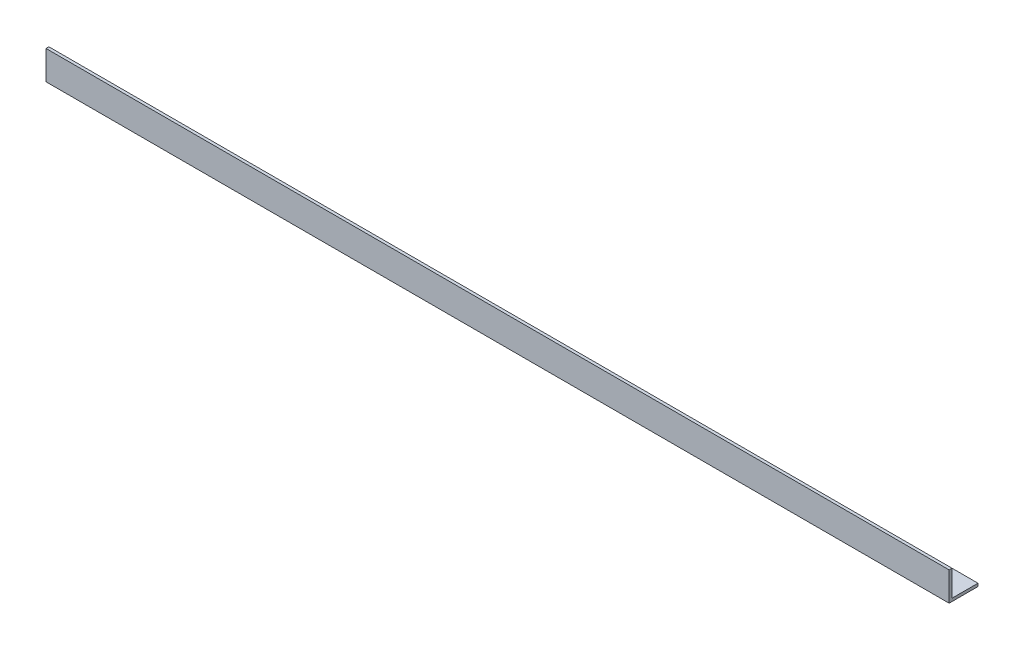
ISO-10303-21;
HEADER;
FILE_DESCRIPTION(('STEP AP214'),'2;1');
FILE_NAME('part.step','',(''),(''),'','','');
FILE_SCHEMA(('AUTOMOTIVE_DESIGN { 1 0 10303 214 1 1 1 1 }'));
ENDSEC;
DATA;
#1=APPLICATION_CONTEXT('core data for automotive mechanical design processes');
#2=APPLICATION_PROTOCOL_DEFINITION('international standard','automotive_design',2000,#1);
#3=PRODUCT_CONTEXT('',#1,'mechanical');
#4=PRODUCT('Part','Part','',(#3));
#5=PRODUCT_RELATED_PRODUCT_CATEGORY('part','',(#4));
#6=PRODUCT_DEFINITION_FORMATION('','',#4);
#7=PRODUCT_DEFINITION_CONTEXT('part definition',#1,'design');
#8=PRODUCT_DEFINITION('design','',#6,#7);
#9=PRODUCT_DEFINITION_SHAPE('','',#8);
#10=(LENGTH_UNIT() NAMED_UNIT(*) SI_UNIT(.MILLI.,.METRE.));
#11=(NAMED_UNIT(*) PLANE_ANGLE_UNIT() SI_UNIT($,.RADIAN.));
#12=(NAMED_UNIT(*) SI_UNIT($,.STERADIAN.) SOLID_ANGLE_UNIT());
#13=UNCERTAINTY_MEASURE_WITH_UNIT(LENGTH_MEASURE(1.E-05),#10,'distance_accuracy_value','');
#14=(GEOMETRIC_REPRESENTATION_CONTEXT(3) GLOBAL_UNCERTAINTY_ASSIGNED_CONTEXT((#13)) GLOBAL_UNIT_ASSIGNED_CONTEXT((#10,
#11,#12)) REPRESENTATION_CONTEXT('',''));
#15=CARTESIAN_POINT('',(0.,0.,0.));
#16=DIRECTION('',(0.,0.,1.));
#17=DIRECTION('',(1.,0.,0.));
#18=AXIS2_PLACEMENT_3D('',#15,#16,#17);
#19=CARTESIAN_POINT('',(469.,0.,-15.));
#20=DIRECTION('',(0.,1.,0.));
#21=DIRECTION('',(0.,0.,1.));
#22=AXIS2_PLACEMENT_3D('',#19,#20,#21);
#23=PLANE('',#22);
#24=DIRECTION('',(0.,0.,-1.));
#25=VECTOR('',#24,1.);
#26=CARTESIAN_POINT('',(0.,0.,-15.));
#27=LINE('',#26,#25);
#28=CARTESIAN_POINT('',(0.,0.,0.));
#29=VERTEX_POINT('',#28);
#30=CARTESIAN_POINT('',(0.,0.,-15.));
#31=VERTEX_POINT('',#30);
#32=EDGE_CURVE('E119',#29,#31,#27,.T.);
#33=ORIENTED_EDGE('',*,*,#32,.T.);
#34=DIRECTION('',(-1.,0.,0.));
#35=VECTOR('',#34,1.);
#36=CARTESIAN_POINT('',(469.,0.,-15.));
#37=LINE('',#36,#35);
#38=CARTESIAN_POINT('',(469.,0.,-15.));
#39=VERTEX_POINT('',#38);
#40=EDGE_CURVE('E11',#39,#31,#37,.T.);
#41=ORIENTED_EDGE('',*,*,#40,.F.);
#42=DIRECTION('',(0.,0.,-1.));
#43=VECTOR('',#42,1.);
#44=CARTESIAN_POINT('',(469.,0.,-15.));
#45=LINE('',#44,#43);
#46=CARTESIAN_POINT('',(469.,0.,0.));
#47=VERTEX_POINT('',#46);
#48=EDGE_CURVE('E129',#47,#39,#45,.T.);
#49=ORIENTED_EDGE('',*,*,#48,.F.);
#50=DIRECTION('',(-1.,0.,0.));
#51=VECTOR('',#50,1.);
#52=CARTESIAN_POINT('',(469.,0.,0.));
#53=LINE('',#52,#51);
#54=EDGE_CURVE('E115',#47,#29,#53,.T.);
#55=ORIENTED_EDGE('',*,*,#54,.T.);
#56=EDGE_LOOP('',(#33,#41,#49,#55));
#57=FACE_BOUND('',#56,.T.);
#58=ADVANCED_FACE('F35',(#57),#23,.F.);
#59=CARTESIAN_POINT('',(469.,1.49999999999998,-15.));
#60=DIRECTION('',(0.,0.,1.));
#61=DIRECTION('',(1.,0.,0.));
#62=AXIS2_PLACEMENT_3D('',#59,#60,#61);
#63=PLANE('',#62);
#64=DIRECTION('',(0.,1.,0.));
#65=VECTOR('',#64,1.);
#66=CARTESIAN_POINT('',(0.,1.49999999999998,-15.));
#67=LINE('',#66,#65);
#68=CARTESIAN_POINT('',(0.,1.49999999999998,-15.));
#69=VERTEX_POINT('',#68);
#70=EDGE_CURVE('E122',#31,#69,#67,.T.);
#71=ORIENTED_EDGE('',*,*,#70,.T.);
#72=DIRECTION('',(-1.,0.,0.));
#73=VECTOR('',#72,1.);
#74=CARTESIAN_POINT('',(469.,1.49999999999998,-15.));
#75=LINE('',#74,#73);
#76=CARTESIAN_POINT('',(469.,1.49999999999998,-15.));
#77=VERTEX_POINT('',#76);
#78=EDGE_CURVE('E43',#77,#69,#75,.T.);
#79=ORIENTED_EDGE('',*,*,#78,.F.);
#80=DIRECTION('',(0.,1.,0.));
#81=VECTOR('',#80,1.);
#82=CARTESIAN_POINT('',(469.,1.49999999999998,-15.));
#83=LINE('',#82,#81);
#84=EDGE_CURVE('E88',#39,#77,#83,.T.);
#85=ORIENTED_EDGE('',*,*,#84,.F.);
#86=ORIENTED_EDGE('',*,*,#40,.T.);
#87=EDGE_LOOP('',(#71,#79,#85,#86));
#88=FACE_BOUND('',#87,.T.);
#89=ADVANCED_FACE('F153',(#88),#63,.F.);
#90=CARTESIAN_POINT('',(469.,1.5,-1.50000000000002));
#91=DIRECTION('',(0.,-1.,0.));
#92=DIRECTION('',(0.,0.,-1.));
#93=AXIS2_PLACEMENT_3D('',#90,#91,#92);
#94=PLANE('',#93);
#95=DIRECTION('',(0.,0.,1.));
#96=VECTOR('',#95,1.);
#97=CARTESIAN_POINT('',(0.,1.5,-1.50000000000002));
#98=LINE('',#97,#96);
#99=CARTESIAN_POINT('',(0.,1.5,-1.50000000000002));
#100=VERTEX_POINT('',#99);
#101=EDGE_CURVE('E124',#69,#100,#98,.T.);
#102=ORIENTED_EDGE('',*,*,#101,.T.);
#103=DIRECTION('',(-1.,0.,0.));
#104=VECTOR('',#103,1.);
#105=CARTESIAN_POINT('',(469.,1.5,-1.50000000000002));
#106=LINE('',#105,#104);
#107=CARTESIAN_POINT('',(469.,1.5,-1.50000000000002));
#108=VERTEX_POINT('',#107);
#109=EDGE_CURVE('E110',#108,#100,#106,.T.);
#110=ORIENTED_EDGE('',*,*,#109,.F.);
#111=DIRECTION('',(0.,0.,1.));
#112=VECTOR('',#111,1.);
#113=CARTESIAN_POINT('',(469.,1.5,-1.50000000000002));
#114=LINE('',#113,#112);
#115=EDGE_CURVE('E101',#77,#108,#114,.T.);
#116=ORIENTED_EDGE('',*,*,#115,.F.);
#117=ORIENTED_EDGE('',*,*,#78,.T.);
#118=EDGE_LOOP('',(#102,#110,#116,#117));
#119=FACE_BOUND('',#118,.T.);
#120=ADVANCED_FACE('F135',(#119),#94,.F.);
#121=CARTESIAN_POINT('',(469.,15.,-1.5));
#122=DIRECTION('',(0.,0.,1.));
#123=DIRECTION('',(0.,-1.,0.));
#124=AXIS2_PLACEMENT_3D('',#121,#122,#123);
#125=PLANE('',#124);
#126=DIRECTION('',(0.,1.,0.));
#127=VECTOR('',#126,1.);
#128=CARTESIAN_POINT('',(0.,15.,-1.5));
#129=LINE('',#128,#127);
#130=CARTESIAN_POINT('',(0.,15.,-1.5));
#131=VERTEX_POINT('',#130);
#132=EDGE_CURVE('E109',#100,#131,#129,.T.);
#133=ORIENTED_EDGE('',*,*,#132,.T.);
#134=DIRECTION('',(-1.,0.,0.));
#135=VECTOR('',#134,1.);
#136=CARTESIAN_POINT('',(469.,15.,-1.5));
#137=LINE('',#136,#135);
#138=CARTESIAN_POINT('',(469.,15.,-1.5));
#139=VERTEX_POINT('',#138);
#140=EDGE_CURVE('E106',#139,#131,#137,.T.);
#141=ORIENTED_EDGE('',*,*,#140,.F.);
#142=DIRECTION('',(0.,1.,0.));
#143=VECTOR('',#142,1.);
#144=CARTESIAN_POINT('',(469.,15.,-1.5));
#145=LINE('',#144,#143);
#146=EDGE_CURVE('E95',#108,#139,#145,.T.);
#147=ORIENTED_EDGE('',*,*,#146,.F.);
#148=ORIENTED_EDGE('',*,*,#109,.T.);
#149=EDGE_LOOP('',(#133,#141,#147,#148));
#150=FACE_BOUND('',#149,.T.);
#151=ADVANCED_FACE('F107',(#150),#125,.F.);
#152=CARTESIAN_POINT('',(469.,15.,0.));
#153=DIRECTION('',(0.,-1.,0.));
#154=DIRECTION('',(0.,0.,-1.));
#155=AXIS2_PLACEMENT_3D('',#152,#153,#154);
#156=PLANE('',#155);
#157=DIRECTION('',(0.,0.,1.));
#158=VECTOR('',#157,1.);
#159=CARTESIAN_POINT('',(0.,15.,0.));
#160=LINE('',#159,#158);
#161=CARTESIAN_POINT('',(0.,15.,0.));
#162=VERTEX_POINT('',#161);
#163=EDGE_CURVE('E74',#131,#162,#160,.T.);
#164=ORIENTED_EDGE('',*,*,#163,.T.);
#165=DIRECTION('',(-1.,0.,0.));
#166=VECTOR('',#165,1.);
#167=CARTESIAN_POINT('',(469.,15.,0.));
#168=LINE('',#167,#166);
#169=CARTESIAN_POINT('',(469.,15.,0.));
#170=VERTEX_POINT('',#169);
#171=EDGE_CURVE('E111',#170,#162,#168,.T.);
#172=ORIENTED_EDGE('',*,*,#171,.F.);
#173=DIRECTION('',(0.,0.,1.));
#174=VECTOR('',#173,1.);
#175=CARTESIAN_POINT('',(469.,15.,0.));
#176=LINE('',#175,#174);
#177=EDGE_CURVE('E99',#139,#170,#176,.T.);
#178=ORIENTED_EDGE('',*,*,#177,.F.);
#179=ORIENTED_EDGE('',*,*,#140,.T.);
#180=EDGE_LOOP('',(#164,#172,#178,#179));
#181=FACE_BOUND('',#180,.T.);
#182=ADVANCED_FACE('F113',(#181),#156,.F.);
#183=CARTESIAN_POINT('',(469.,0.,0.));
#184=DIRECTION('',(0.,0.,-1.));
#185=DIRECTION('',(-1.,0.,0.));
#186=AXIS2_PLACEMENT_3D('',#183,#184,#185);
#187=PLANE('',#186);
#188=DIRECTION('',(0.,-1.,0.));
#189=VECTOR('',#188,1.);
#190=CARTESIAN_POINT('',(0.,0.,0.));
#191=LINE('',#190,#189);
#192=EDGE_CURVE('E80',#162,#29,#191,.T.);
#193=ORIENTED_EDGE('',*,*,#192,.T.);
#194=ORIENTED_EDGE('',*,*,#54,.F.);
#195=DIRECTION('',(0.,-1.,0.));
#196=VECTOR('',#195,1.);
#197=CARTESIAN_POINT('',(469.,0.,0.));
#198=LINE('',#197,#196);
#199=EDGE_CURVE('E51',#170,#47,#198,.T.);
#200=ORIENTED_EDGE('',*,*,#199,.F.);
#201=ORIENTED_EDGE('',*,*,#171,.T.);
#202=EDGE_LOOP('',(#193,#194,#200,#201));
#203=FACE_BOUND('',#202,.T.);
#204=ADVANCED_FACE('F142',(#203),#187,.F.);
#205=CARTESIAN_POINT('',(469.,0.,0.));
#206=DIRECTION('',(-1.,0.,0.));
#207=DIRECTION('',(0.,0.,1.));
#208=AXIS2_PLACEMENT_3D('',#205,#206,#207);
#209=PLANE('',#208);
#210=ORIENTED_EDGE('',*,*,#48,.T.);
#211=ORIENTED_EDGE('',*,*,#84,.T.);
#212=ORIENTED_EDGE('',*,*,#115,.T.);
#213=ORIENTED_EDGE('',*,*,#146,.T.);
#214=ORIENTED_EDGE('',*,*,#177,.T.);
#215=ORIENTED_EDGE('',*,*,#199,.T.);
#216=EDGE_LOOP('',(#210,#211,#212,#213,#214,#215));
#217=FACE_BOUND('',#216,.T.);
#218=ADVANCED_FACE('F97',(#217),#209,.F.);
#219=CARTESIAN_POINT('',(0.,0.,0.));
#220=DIRECTION('',(-1.,0.,0.));
#221=DIRECTION('',(0.,0.,1.));
#222=AXIS2_PLACEMENT_3D('',#219,#220,#221);
#223=PLANE('',#222);
#224=ORIENTED_EDGE('',*,*,#32,.F.);
#225=ORIENTED_EDGE('',*,*,#192,.F.);
#226=ORIENTED_EDGE('',*,*,#163,.F.);
#227=ORIENTED_EDGE('',*,*,#132,.F.);
#228=ORIENTED_EDGE('',*,*,#101,.F.);
#229=ORIENTED_EDGE('',*,*,#70,.F.);
#230=EDGE_LOOP('',(#224,#225,#226,#227,#228,#229));
#231=FACE_BOUND('',#230,.T.);
#232=ADVANCED_FACE('F138',(#231),#223,.T.);
#233=CLOSED_SHELL('',(#58,#89,#120,#151,#182,#204,#218,#232));
#234=MANIFOLD_SOLID_BREP('B2',#233);
#235=ADVANCED_BREP_SHAPE_REPRESENTATION('',(#18,#234),#14);
#236=SHAPE_DEFINITION_REPRESENTATION(#9,#235);
ENDSEC;
END-ISO-10303-21;
